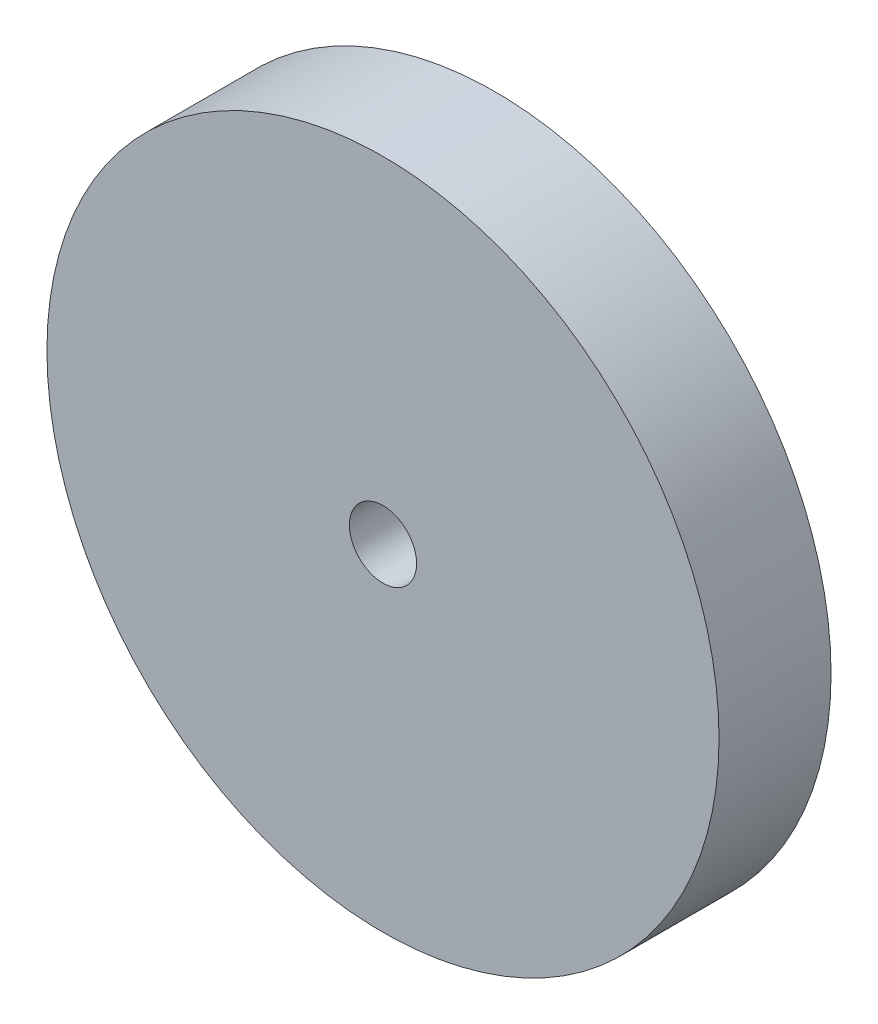
ISO-10303-21;
HEADER;
FILE_DESCRIPTION(('STEP AP214'),'2;1');
FILE_NAME('part.step','',(''),(''),'','','');
FILE_SCHEMA(('AUTOMOTIVE_DESIGN { 1 0 10303 214 1 1 1 1 }'));
ENDSEC;
DATA;
#1=APPLICATION_CONTEXT('core data for automotive mechanical design processes');
#2=APPLICATION_PROTOCOL_DEFINITION('international standard','automotive_design',2000,#1);
#3=PRODUCT_CONTEXT('',#1,'mechanical');
#4=PRODUCT('Part','Part','',(#3));
#5=PRODUCT_RELATED_PRODUCT_CATEGORY('part','',(#4));
#6=PRODUCT_DEFINITION_FORMATION('','',#4);
#7=PRODUCT_DEFINITION_CONTEXT('part definition',#1,'design');
#8=PRODUCT_DEFINITION('design','',#6,#7);
#9=PRODUCT_DEFINITION_SHAPE('','',#8);
#10=(LENGTH_UNIT() NAMED_UNIT(*) SI_UNIT(.MILLI.,.METRE.));
#11=(NAMED_UNIT(*) PLANE_ANGLE_UNIT() SI_UNIT($,.RADIAN.));
#12=(NAMED_UNIT(*) SI_UNIT($,.STERADIAN.) SOLID_ANGLE_UNIT());
#13=UNCERTAINTY_MEASURE_WITH_UNIT(LENGTH_MEASURE(1.E-05),#10,'distance_accuracy_value','');
#14=(GEOMETRIC_REPRESENTATION_CONTEXT(3) GLOBAL_UNCERTAINTY_ASSIGNED_CONTEXT((#13)) GLOBAL_UNIT_ASSIGNED_CONTEXT((#10,
#11,#12)) REPRESENTATION_CONTEXT('',''));
#15=CARTESIAN_POINT('',(0.,0.,0.));
#16=DIRECTION('',(0.,0.,1.));
#17=DIRECTION('',(1.,0.,0.));
#18=AXIS2_PLACEMENT_3D('',#15,#16,#17);
#19=CARTESIAN_POINT('',(0.,0.,20.));
#20=DIRECTION('',(0.,0.,-1.));
#21=DIRECTION('',(-1.,0.,0.));
#22=AXIS2_PLACEMENT_3D('',#19,#20,#21);
#23=CYLINDRICAL_SURFACE('',#22,60.);
#24=CARTESIAN_POINT('',(0.,0.,20.));
#25=DIRECTION('',(0.,0.,1.));
#26=DIRECTION('',(1.,0.,0.));
#27=AXIS2_PLACEMENT_3D('',#24,#25,#26);
#28=CIRCLE('',#27,60.);
#29=CARTESIAN_POINT('',(60.,0.,20.));
#30=VERTEX_POINT('',#29);
#31=EDGE_CURVE('E10',#30,#30,#28,.T.);
#32=ORIENTED_EDGE('',*,*,#31,.F.);
#33=EDGE_LOOP('',(#32));
#34=FACE_BOUND('',#33,.T.);
#35=CARTESIAN_POINT('',(0.,0.,0.));
#36=DIRECTION('',(0.,0.,1.));
#37=DIRECTION('',(1.,0.,0.));
#38=AXIS2_PLACEMENT_3D('',#35,#36,#37);
#39=CIRCLE('',#38,60.);
#40=CARTESIAN_POINT('',(60.,0.,0.));
#41=VERTEX_POINT('',#40);
#42=EDGE_CURVE('E34',#41,#41,#39,.T.);
#43=ORIENTED_EDGE('',*,*,#42,.T.);
#44=EDGE_LOOP('',(#43));
#45=FACE_BOUND('',#44,.T.);
#46=ADVANCED_FACE('F31',(#34,#45),#23,.T.);
#47=CARTESIAN_POINT('',(0.,0.,20.));
#48=DIRECTION('',(0.,0.,1.));
#49=DIRECTION('',(1.,0.,0.));
#50=AXIS2_PLACEMENT_3D('',#47,#48,#49);
#51=PLANE('',#50);
#52=CARTESIAN_POINT('',(0.,0.,20.));
#53=DIRECTION('',(0.,0.,1.));
#54=DIRECTION('',(1.,0.,0.));
#55=AXIS2_PLACEMENT_3D('',#52,#53,#54);
#56=CIRCLE('',#55,6.);
#57=CARTESIAN_POINT('',(6.,0.,20.));
#58=VERTEX_POINT('',#57);
#59=EDGE_CURVE('E43',#58,#58,#56,.T.);
#60=ORIENTED_EDGE('',*,*,#59,.F.);
#61=EDGE_LOOP('',(#60));
#62=FACE_BOUND('',#61,.T.);
#63=ORIENTED_EDGE('',*,*,#31,.T.);
#64=EDGE_LOOP('',(#63));
#65=FACE_BOUND('',#64,.T.);
#66=ADVANCED_FACE('F58',(#62,#65),#51,.T.);
#67=CARTESIAN_POINT('',(0.,0.,0.));
#68=DIRECTION('',(0.,0.,1.));
#69=DIRECTION('',(1.,0.,0.));
#70=AXIS2_PLACEMENT_3D('',#67,#68,#69);
#71=PLANE('',#70);
#72=CARTESIAN_POINT('',(0.,0.,0.));
#73=DIRECTION('',(0.,0.,1.));
#74=DIRECTION('',(1.,0.,0.));
#75=AXIS2_PLACEMENT_3D('',#72,#73,#74);
#76=CIRCLE('',#75,6.);
#77=CARTESIAN_POINT('',(6.,0.,0.));
#78=VERTEX_POINT('',#77);
#79=EDGE_CURVE('E41',#78,#78,#76,.T.);
#80=ORIENTED_EDGE('',*,*,#79,.T.);
#81=EDGE_LOOP('',(#80));
#82=FACE_BOUND('',#81,.T.);
#83=ORIENTED_EDGE('',*,*,#42,.F.);
#84=EDGE_LOOP('',(#83));
#85=FACE_BOUND('',#84,.T.);
#86=ADVANCED_FACE('F49',(#82,#85),#71,.F.);
#87=CARTESIAN_POINT('',(0.,0.,0.));
#88=DIRECTION('',(0.,0.,1.));
#89=DIRECTION('',(1.,0.,0.));
#90=AXIS2_PLACEMENT_3D('',#87,#88,#89);
#91=CYLINDRICAL_SURFACE('',#90,6.);
#92=ORIENTED_EDGE('',*,*,#79,.F.);
#93=EDGE_LOOP('',(#92));
#94=FACE_BOUND('',#93,.T.);
#95=ORIENTED_EDGE('',*,*,#59,.T.);
#96=EDGE_LOOP('',(#95));
#97=FACE_BOUND('',#96,.T.);
#98=ADVANCED_FACE('F52',(#94,#97),#91,.F.);
#99=CLOSED_SHELL('',(#46,#66,#86,#98));
#100=MANIFOLD_SOLID_BREP('B2',#99);
#101=ADVANCED_BREP_SHAPE_REPRESENTATION('',(#18,#100),#14);
#102=SHAPE_DEFINITION_REPRESENTATION(#9,#101);
ENDSEC;
END-ISO-10303-21;
